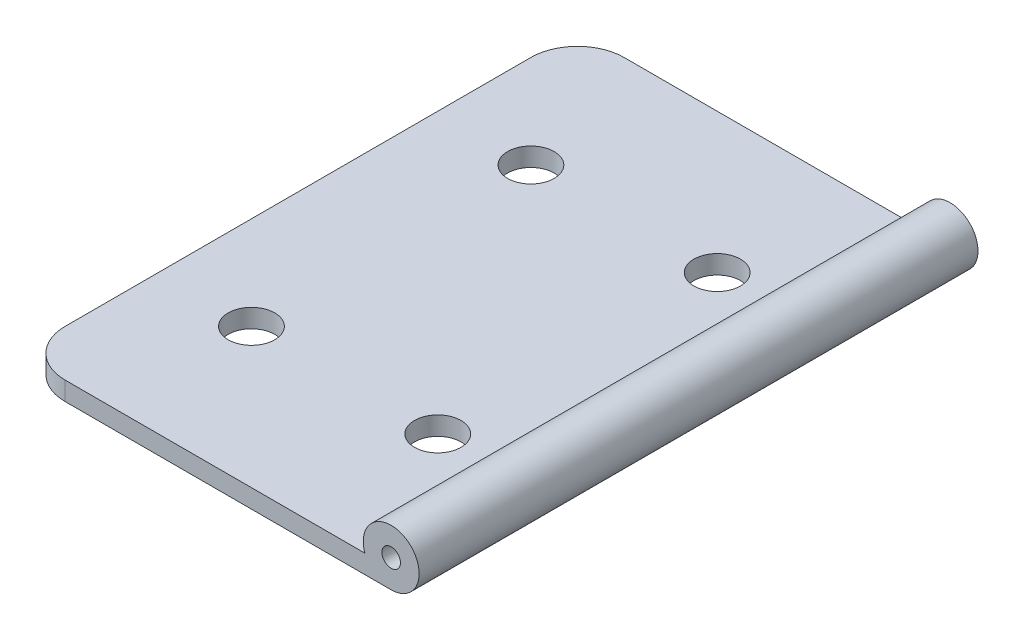
ISO-10303-21;
HEADER;
FILE_DESCRIPTION(('STEP AP214'),'2;1');
FILE_NAME('part.step','',(''),(''),'','','');
FILE_SCHEMA(('AUTOMOTIVE_DESIGN { 1 0 10303 214 1 1 1 1 }'));
ENDSEC;
DATA;
#1=APPLICATION_CONTEXT('core data for automotive mechanical design processes');
#2=APPLICATION_PROTOCOL_DEFINITION('international standard','automotive_design',2000,#1);
#3=PRODUCT_CONTEXT('',#1,'mechanical');
#4=PRODUCT('Part','Part','',(#3));
#5=PRODUCT_RELATED_PRODUCT_CATEGORY('part','',(#4));
#6=PRODUCT_DEFINITION_FORMATION('','',#4);
#7=PRODUCT_DEFINITION_CONTEXT('part definition',#1,'design');
#8=PRODUCT_DEFINITION('design','',#6,#7);
#9=PRODUCT_DEFINITION_SHAPE('','',#8);
#10=(LENGTH_UNIT() NAMED_UNIT(*) SI_UNIT(.MILLI.,.METRE.));
#11=(NAMED_UNIT(*) PLANE_ANGLE_UNIT() SI_UNIT($,.RADIAN.));
#12=(NAMED_UNIT(*) SI_UNIT($,.STERADIAN.) SOLID_ANGLE_UNIT());
#13=UNCERTAINTY_MEASURE_WITH_UNIT(LENGTH_MEASURE(1.E-05),#10,'distance_accuracy_value','');
#14=(GEOMETRIC_REPRESENTATION_CONTEXT(3) GLOBAL_UNCERTAINTY_ASSIGNED_CONTEXT((#13)) GLOBAL_UNIT_ASSIGNED_CONTEXT((#10,
#11,#12)) REPRESENTATION_CONTEXT('',''));
#15=CARTESIAN_POINT('',(0.,0.,0.));
#16=DIRECTION('',(0.,0.,1.));
#17=DIRECTION('',(1.,0.,0.));
#18=AXIS2_PLACEMENT_3D('',#15,#16,#17);
#19=CARTESIAN_POINT('',(0.,2.,0.));
#20=DIRECTION('',(0.,1.,0.));
#21=DIRECTION('',(0.,0.,1.));
#22=AXIS2_PLACEMENT_3D('',#19,#20,#21);
#23=PLANE('',#22);
#24=DIRECTION('',(0.,0.,1.));
#25=VECTOR('',#24,1.);
#26=CARTESIAN_POINT('',(-2.82842712474618,2.,-38.4852813742386));
#27=LINE('',#26,#25);
#28=CARTESIAN_POINT('',(-2.82842712474618,2.,-30.));
#29=VERTEX_POINT('',#28);
#30=CARTESIAN_POINT('',(-2.82842712474618,2.,30.));
#31=VERTEX_POINT('',#30);
#32=EDGE_CURVE('E88',#29,#31,#27,.T.);
#33=ORIENTED_EDGE('',*,*,#32,.F.);
#34=DIRECTION('',(-1.,0.,0.));
#35=VECTOR('',#34,1.);
#36=CARTESIAN_POINT('',(-40.,2.,-30.));
#37=LINE('',#36,#35);
#38=CARTESIAN_POINT('',(-35.,2.,-30.));
#39=VERTEX_POINT('',#38);
#40=EDGE_CURVE('E54',#29,#39,#37,.T.);
#41=ORIENTED_EDGE('',*,*,#40,.T.);
#42=CARTESIAN_POINT('',(-35.,2.,-25.));
#43=DIRECTION('',(0.,1.,0.));
#44=DIRECTION('',(0.,0.,1.));
#45=AXIS2_PLACEMENT_3D('',#42,#43,#44);
#46=CIRCLE('',#45,5.);
#47=CARTESIAN_POINT('',(-40.,2.,-25.));
#48=VERTEX_POINT('',#47);
#49=EDGE_CURVE('E40',#39,#48,#46,.T.);
#50=ORIENTED_EDGE('',*,*,#49,.T.);
#51=DIRECTION('',(0.,0.,1.));
#52=VECTOR('',#51,1.);
#53=CARTESIAN_POINT('',(-40.,2.,-30.));
#54=LINE('',#53,#52);
#55=CARTESIAN_POINT('',(-40.,2.,25.));
#56=VERTEX_POINT('',#55);
#57=EDGE_CURVE('E107',#48,#56,#54,.T.);
#58=ORIENTED_EDGE('',*,*,#57,.T.);
#59=CARTESIAN_POINT('',(-35.,2.,25.));
#60=DIRECTION('',(0.,1.,0.));
#61=DIRECTION('',(0.,0.,1.));
#62=AXIS2_PLACEMENT_3D('',#59,#60,#61);
#63=CIRCLE('',#62,5.);
#64=CARTESIAN_POINT('',(-35.,2.,30.));
#65=VERTEX_POINT('',#64);
#66=EDGE_CURVE('E47',#56,#65,#63,.T.);
#67=ORIENTED_EDGE('',*,*,#66,.T.);
#68=DIRECTION('',(1.,0.,0.));
#69=VECTOR('',#68,1.);
#70=CARTESIAN_POINT('',(-40.,2.,30.));
#71=LINE('',#70,#69);
#72=EDGE_CURVE('E99',#65,#31,#71,.T.);
#73=ORIENTED_EDGE('',*,*,#72,.T.);
#74=EDGE_LOOP('',(#33,#41,#50,#58,#67,#73));
#75=FACE_BOUND('',#74,.T.);
#76=CARTESIAN_POINT('',(-10.,2.,15.));
#77=DIRECTION('',(0.,1.,0.));
#78=DIRECTION('',(0.,0.,1.));
#79=AXIS2_PLACEMENT_3D('',#76,#77,#78);
#80=CIRCLE('',#79,2.5);
#81=CARTESIAN_POINT('',(-10.,2.,17.5));
#82=VERTEX_POINT('',#81);
#83=EDGE_CURVE('E164',#82,#82,#80,.T.);
#84=ORIENTED_EDGE('',*,*,#83,.F.);
#85=EDGE_LOOP('',(#84));
#86=FACE_BOUND('',#85,.T.);
#87=CARTESIAN_POINT('',(-30.,2.,-15.));
#88=DIRECTION('',(0.,1.,0.));
#89=DIRECTION('',(0.,0.,1.));
#90=AXIS2_PLACEMENT_3D('',#87,#88,#89);
#91=CIRCLE('',#90,2.5);
#92=CARTESIAN_POINT('',(-30.,2.,-12.5));
#93=VERTEX_POINT('',#92);
#94=EDGE_CURVE('E122',#93,#93,#91,.T.);
#95=ORIENTED_EDGE('',*,*,#94,.F.);
#96=EDGE_LOOP('',(#95));
#97=FACE_BOUND('',#96,.T.);
#98=CARTESIAN_POINT('',(-10.,2.,-15.));
#99=DIRECTION('',(0.,1.,0.));
#100=DIRECTION('',(0.,0.,-1.));
#101=AXIS2_PLACEMENT_3D('',#98,#99,#100);
#102=CIRCLE('',#101,2.5);
#103=CARTESIAN_POINT('',(-10.,2.,-17.5));
#104=VERTEX_POINT('',#103);
#105=EDGE_CURVE('E170',#104,#104,#102,.T.);
#106=ORIENTED_EDGE('',*,*,#105,.F.);
#107=EDGE_LOOP('',(#106));
#108=FACE_BOUND('',#107,.T.);
#109=CARTESIAN_POINT('',(-30.,2.,15.));
#110=DIRECTION('',(0.,1.,0.));
#111=DIRECTION('',(0.,0.,-1.));
#112=AXIS2_PLACEMENT_3D('',#109,#110,#111);
#113=CIRCLE('',#112,2.5);
#114=CARTESIAN_POINT('',(-30.,2.,12.5));
#115=VERTEX_POINT('',#114);
#116=EDGE_CURVE('E158',#115,#115,#113,.T.);
#117=ORIENTED_EDGE('',*,*,#116,.F.);
#118=EDGE_LOOP('',(#117));
#119=FACE_BOUND('',#118,.T.);
#120=ADVANCED_FACE('F32',(#75,#86,#97,#108,#119),#23,.T.);
#121=CARTESIAN_POINT('',(0.,0.,0.));
#122=DIRECTION('',(0.,1.,0.));
#123=DIRECTION('',(0.,0.,1.));
#124=AXIS2_PLACEMENT_3D('',#121,#122,#123);
#125=PLANE('',#124);
#126=DIRECTION('',(0.,0.,1.));
#127=VECTOR('',#126,1.);
#128=CARTESIAN_POINT('',(-40.,0.,-30.));
#129=LINE('',#128,#127);
#130=CARTESIAN_POINT('',(-40.,0.,-25.));
#131=VERTEX_POINT('',#130);
#132=CARTESIAN_POINT('',(-40.,0.,25.));
#133=VERTEX_POINT('',#132);
#134=EDGE_CURVE('E112',#131,#133,#129,.T.);
#135=ORIENTED_EDGE('',*,*,#134,.F.);
#136=CARTESIAN_POINT('',(-35.,0.,-25.));
#137=DIRECTION('',(0.,1.,0.));
#138=DIRECTION('',(0.,0.,1.));
#139=AXIS2_PLACEMENT_3D('',#136,#137,#138);
#140=CIRCLE('',#139,5.);
#141=CARTESIAN_POINT('',(-35.,0.,-30.));
#142=VERTEX_POINT('',#141);
#143=EDGE_CURVE('E132',#131,#142,#140,.F.);
#144=ORIENTED_EDGE('',*,*,#143,.T.);
#145=DIRECTION('',(-1.,0.,0.));
#146=VECTOR('',#145,1.);
#147=CARTESIAN_POINT('',(-40.,0.,-30.));
#148=LINE('',#147,#146);
#149=CARTESIAN_POINT('',(0.,0.,-30.));
#150=VERTEX_POINT('',#149);
#151=EDGE_CURVE('E121',#150,#142,#148,.T.);
#152=ORIENTED_EDGE('',*,*,#151,.F.);
#153=DIRECTION('',(0.,0.,-1.));
#154=VECTOR('',#153,1.);
#155=CARTESIAN_POINT('',(0.,0.,-30.));
#156=LINE('',#155,#154);
#157=CARTESIAN_POINT('',(0.,0.,30.));
#158=VERTEX_POINT('',#157);
#159=EDGE_CURVE('E91',#158,#150,#156,.T.);
#160=ORIENTED_EDGE('',*,*,#159,.F.);
#161=DIRECTION('',(1.,0.,0.));
#162=VECTOR('',#161,1.);
#163=CARTESIAN_POINT('',(-40.,0.,30.));
#164=LINE('',#163,#162);
#165=CARTESIAN_POINT('',(-35.,0.,30.));
#166=VERTEX_POINT('',#165);
#167=EDGE_CURVE('E108',#166,#158,#164,.T.);
#168=ORIENTED_EDGE('',*,*,#167,.F.);
#169=CARTESIAN_POINT('',(-35.,0.,25.));
#170=DIRECTION('',(0.,1.,0.));
#171=DIRECTION('',(0.,0.,1.));
#172=AXIS2_PLACEMENT_3D('',#169,#170,#171);
#173=CIRCLE('',#172,5.);
#174=EDGE_CURVE('E130',#166,#133,#173,.F.);
#175=ORIENTED_EDGE('',*,*,#174,.T.);
#176=EDGE_LOOP('',(#135,#144,#152,#160,#168,#175));
#177=FACE_BOUND('',#176,.T.);
#178=CARTESIAN_POINT('',(-30.,0.,-15.));
#179=DIRECTION('',(0.,1.,0.));
#180=DIRECTION('',(0.,0.,1.));
#181=AXIS2_PLACEMENT_3D('',#178,#179,#180);
#182=CIRCLE('',#181,2.5);
#183=CARTESIAN_POINT('',(-30.,0.,-12.5));
#184=VERTEX_POINT('',#183);
#185=EDGE_CURVE('E115',#184,#184,#182,.T.);
#186=ORIENTED_EDGE('',*,*,#185,.T.);
#187=EDGE_LOOP('',(#186));
#188=FACE_BOUND('',#187,.T.);
#189=CARTESIAN_POINT('',(-10.,0.,-15.));
#190=DIRECTION('',(0.,1.,0.));
#191=DIRECTION('',(0.,0.,-1.));
#192=AXIS2_PLACEMENT_3D('',#189,#190,#191);
#193=CIRCLE('',#192,2.5);
#194=CARTESIAN_POINT('',(-10.,0.,-17.5));
#195=VERTEX_POINT('',#194);
#196=EDGE_CURVE('E167',#195,#195,#193,.T.);
#197=ORIENTED_EDGE('',*,*,#196,.T.);
#198=EDGE_LOOP('',(#197));
#199=FACE_BOUND('',#198,.T.);
#200=CARTESIAN_POINT('',(-10.,0.,15.));
#201=DIRECTION('',(0.,1.,0.));
#202=DIRECTION('',(0.,0.,1.));
#203=AXIS2_PLACEMENT_3D('',#200,#201,#202);
#204=CIRCLE('',#203,2.5);
#205=CARTESIAN_POINT('',(-10.,0.,17.5));
#206=VERTEX_POINT('',#205);
#207=EDGE_CURVE('E161',#206,#206,#204,.T.);
#208=ORIENTED_EDGE('',*,*,#207,.T.);
#209=EDGE_LOOP('',(#208));
#210=FACE_BOUND('',#209,.T.);
#211=CARTESIAN_POINT('',(-30.,0.,15.));
#212=DIRECTION('',(0.,1.,0.));
#213=DIRECTION('',(0.,0.,-1.));
#214=AXIS2_PLACEMENT_3D('',#211,#212,#213);
#215=CIRCLE('',#214,2.5);
#216=CARTESIAN_POINT('',(-30.,0.,12.5));
#217=VERTEX_POINT('',#216);
#218=EDGE_CURVE('E100',#217,#217,#215,.T.);
#219=ORIENTED_EDGE('',*,*,#218,.T.);
#220=EDGE_LOOP('',(#219));
#221=FACE_BOUND('',#220,.T.);
#222=ADVANCED_FACE('F144',(#177,#188,#199,#210,#221),#125,.F.);
#223=CARTESIAN_POINT('',(-40.,2.,-30.));
#224=DIRECTION('',(0.,0.,1.));
#225=DIRECTION('',(1.,0.,0.));
#226=AXIS2_PLACEMENT_3D('',#223,#224,#225);
#227=PLANE('',#226);
#228=ORIENTED_EDGE('',*,*,#40,.F.);
#229=CARTESIAN_POINT('',(0.,3.,-30.));
#230=DIRECTION('',(0.,0.,1.));
#231=DIRECTION('',(1.,0.,0.));
#232=AXIS2_PLACEMENT_3D('',#229,#230,#231);
#233=CIRCLE('',#232,3.);
#234=EDGE_CURVE('E86',#29,#150,#233,.F.);
#235=ORIENTED_EDGE('',*,*,#234,.T.);
#236=ORIENTED_EDGE('',*,*,#151,.T.);
#237=DIRECTION('',(0.,-1.,0.));
#238=VECTOR('',#237,1.);
#239=CARTESIAN_POINT('',(-35.,2.,-30.));
#240=LINE('',#239,#238);
#241=EDGE_CURVE('E105',#142,#39,#240,.F.);
#242=ORIENTED_EDGE('',*,*,#241,.T.);
#243=EDGE_LOOP('',(#228,#235,#236,#242));
#244=FACE_BOUND('',#243,.T.);
#245=CARTESIAN_POINT('',(0.,3.,-30.));
#246=DIRECTION('',(0.,0.,1.));
#247=DIRECTION('',(1.,0.,0.));
#248=AXIS2_PLACEMENT_3D('',#245,#246,#247);
#249=CIRCLE('',#248,1.);
#250=CARTESIAN_POINT('',(1.00000000000001,3.,-30.));
#251=VERTEX_POINT('',#250);
#252=EDGE_CURVE('E95',#251,#251,#249,.F.);
#253=ORIENTED_EDGE('',*,*,#252,.F.);
#254=EDGE_LOOP('',(#253));
#255=FACE_BOUND('',#254,.T.);
#256=ADVANCED_FACE('F102',(#244,#255),#227,.F.);
#257=CARTESIAN_POINT('',(-40.,2.,-30.));
#258=DIRECTION('',(1.,0.,0.));
#259=DIRECTION('',(0.,0.,-1.));
#260=AXIS2_PLACEMENT_3D('',#257,#258,#259);
#261=PLANE('',#260);
#262=ORIENTED_EDGE('',*,*,#57,.F.);
#263=DIRECTION('',(0.,-1.,0.));
#264=VECTOR('',#263,1.);
#265=CARTESIAN_POINT('',(-40.,2.,-25.));
#266=LINE('',#265,#264);
#267=EDGE_CURVE('E127',#48,#131,#266,.T.);
#268=ORIENTED_EDGE('',*,*,#267,.T.);
#269=ORIENTED_EDGE('',*,*,#134,.T.);
#270=DIRECTION('',(0.,-1.,0.));
#271=VECTOR('',#270,1.);
#272=CARTESIAN_POINT('',(-40.,2.,25.));
#273=LINE('',#272,#271);
#274=EDGE_CURVE('E119',#133,#56,#273,.F.);
#275=ORIENTED_EDGE('',*,*,#274,.T.);
#276=EDGE_LOOP('',(#262,#268,#269,#275));
#277=FACE_BOUND('',#276,.T.);
#278=ADVANCED_FACE('F139',(#277),#261,.F.);
#279=CARTESIAN_POINT('',(-40.,2.,30.));
#280=DIRECTION('',(0.,0.,-1.));
#281=DIRECTION('',(-1.,0.,0.));
#282=AXIS2_PLACEMENT_3D('',#279,#280,#281);
#283=PLANE('',#282);
#284=CARTESIAN_POINT('',(0.,3.,30.));
#285=DIRECTION('',(0.,0.,1.));
#286=DIRECTION('',(1.,0.,0.));
#287=AXIS2_PLACEMENT_3D('',#284,#285,#286);
#288=CIRCLE('',#287,1.);
#289=CARTESIAN_POINT('',(1.00000000000001,3.,30.));
#290=VERTEX_POINT('',#289);
#291=EDGE_CURVE('E151',#290,#290,#288,.T.);
#292=ORIENTED_EDGE('',*,*,#291,.F.);
#293=EDGE_LOOP('',(#292));
#294=FACE_BOUND('',#293,.T.);
#295=ORIENTED_EDGE('',*,*,#167,.T.);
#296=CARTESIAN_POINT('',(0.,3.,30.));
#297=DIRECTION('',(0.,0.,1.));
#298=DIRECTION('',(1.,0.,0.));
#299=AXIS2_PLACEMENT_3D('',#296,#297,#298);
#300=CIRCLE('',#299,3.);
#301=EDGE_CURVE('E96',#158,#31,#300,.T.);
#302=ORIENTED_EDGE('',*,*,#301,.T.);
#303=ORIENTED_EDGE('',*,*,#72,.F.);
#304=DIRECTION('',(0.,-1.,0.));
#305=VECTOR('',#304,1.);
#306=CARTESIAN_POINT('',(-35.,2.,30.));
#307=LINE('',#306,#305);
#308=EDGE_CURVE('E11',#65,#166,#307,.T.);
#309=ORIENTED_EDGE('',*,*,#308,.T.);
#310=EDGE_LOOP('',(#295,#302,#303,#309));
#311=FACE_BOUND('',#310,.T.);
#312=ADVANCED_FACE('F150',(#294,#311),#283,.F.);
#313=CARTESIAN_POINT('',(-30.,2.,-15.));
#314=DIRECTION('',(0.,-1.,0.));
#315=DIRECTION('',(0.,0.,-1.));
#316=AXIS2_PLACEMENT_3D('',#313,#314,#315);
#317=CYLINDRICAL_SURFACE('',#316,2.5);
#318=ORIENTED_EDGE('',*,*,#94,.T.);
#319=EDGE_LOOP('',(#318));
#320=FACE_BOUND('',#319,.T.);
#321=ORIENTED_EDGE('',*,*,#185,.F.);
#322=EDGE_LOOP('',(#321));
#323=FACE_BOUND('',#322,.T.);
#324=ADVANCED_FACE('F181',(#320,#323),#317,.F.);
#325=CARTESIAN_POINT('',(-10.,2.,-15.));
#326=DIRECTION('',(0.,-1.,0.));
#327=DIRECTION('',(0.,0.,-1.));
#328=AXIS2_PLACEMENT_3D('',#325,#326,#327);
#329=CYLINDRICAL_SURFACE('',#328,2.5);
#330=ORIENTED_EDGE('',*,*,#105,.T.);
#331=EDGE_LOOP('',(#330));
#332=FACE_BOUND('',#331,.T.);
#333=ORIENTED_EDGE('',*,*,#196,.F.);
#334=EDGE_LOOP('',(#333));
#335=FACE_BOUND('',#334,.T.);
#336=ADVANCED_FACE('F183',(#332,#335),#329,.F.);
#337=CARTESIAN_POINT('',(-10.,2.,15.));
#338=DIRECTION('',(0.,-1.,0.));
#339=DIRECTION('',(0.,0.,-1.));
#340=AXIS2_PLACEMENT_3D('',#337,#338,#339);
#341=CYLINDRICAL_SURFACE('',#340,2.5);
#342=ORIENTED_EDGE('',*,*,#83,.T.);
#343=EDGE_LOOP('',(#342));
#344=FACE_BOUND('',#343,.T.);
#345=ORIENTED_EDGE('',*,*,#207,.F.);
#346=EDGE_LOOP('',(#345));
#347=FACE_BOUND('',#346,.T.);
#348=ADVANCED_FACE('F189',(#344,#347),#341,.F.);
#349=CARTESIAN_POINT('',(-30.,2.,15.));
#350=DIRECTION('',(0.,-1.,0.));
#351=DIRECTION('',(0.,0.,-1.));
#352=AXIS2_PLACEMENT_3D('',#349,#350,#351);
#353=CYLINDRICAL_SURFACE('',#352,2.5);
#354=ORIENTED_EDGE('',*,*,#116,.T.);
#355=EDGE_LOOP('',(#354));
#356=FACE_BOUND('',#355,.T.);
#357=ORIENTED_EDGE('',*,*,#218,.F.);
#358=EDGE_LOOP('',(#357));
#359=FACE_BOUND('',#358,.T.);
#360=ADVANCED_FACE('F205',(#356,#359),#353,.F.);
#361=CARTESIAN_POINT('',(-35.,2.,-25.));
#362=DIRECTION('',(0.,-1.,0.));
#363=DIRECTION('',(0.,0.,-1.));
#364=AXIS2_PLACEMENT_3D('',#361,#362,#363);
#365=CYLINDRICAL_SURFACE('',#364,5.);
#366=ORIENTED_EDGE('',*,*,#49,.F.);
#367=ORIENTED_EDGE('',*,*,#241,.F.);
#368=ORIENTED_EDGE('',*,*,#143,.F.);
#369=ORIENTED_EDGE('',*,*,#267,.F.);
#370=EDGE_LOOP('',(#366,#367,#368,#369));
#371=FACE_BOUND('',#370,.T.);
#372=ADVANCED_FACE('F142',(#371),#365,.T.);
#373=CARTESIAN_POINT('',(-35.,2.,25.));
#374=DIRECTION('',(0.,-1.,0.));
#375=DIRECTION('',(0.,0.,-1.));
#376=AXIS2_PLACEMENT_3D('',#373,#374,#375);
#377=CYLINDRICAL_SURFACE('',#376,5.);
#378=ORIENTED_EDGE('',*,*,#66,.F.);
#379=ORIENTED_EDGE('',*,*,#274,.F.);
#380=ORIENTED_EDGE('',*,*,#174,.F.);
#381=ORIENTED_EDGE('',*,*,#308,.F.);
#382=EDGE_LOOP('',(#378,#379,#380,#381));
#383=FACE_BOUND('',#382,.T.);
#384=ADVANCED_FACE('F34',(#383),#377,.T.);
#385=CARTESIAN_POINT('',(0.,3.,-38.4852813742386));
#386=DIRECTION('',(0.,0.,1.));
#387=DIRECTION('',(1.,0.,0.));
#388=AXIS2_PLACEMENT_3D('',#385,#386,#387);
#389=CYLINDRICAL_SURFACE('',#388,3.);
#390=ORIENTED_EDGE('',*,*,#234,.F.);
#391=ORIENTED_EDGE('',*,*,#32,.T.);
#392=ORIENTED_EDGE('',*,*,#301,.F.);
#393=ORIENTED_EDGE('',*,*,#159,.T.);
#394=EDGE_LOOP('',(#390,#391,#392,#393));
#395=FACE_BOUND('',#394,.T.);
#396=ADVANCED_FACE('F87',(#395),#389,.T.);
#397=CARTESIAN_POINT('',(0.,3.,-38.4852813742386));
#398=DIRECTION('',(0.,0.,1.));
#399=DIRECTION('',(1.,0.,0.));
#400=AXIS2_PLACEMENT_3D('',#397,#398,#399);
#401=CYLINDRICAL_SURFACE('',#400,1.);
#402=ORIENTED_EDGE('',*,*,#291,.T.);
#403=EDGE_LOOP('',(#402));
#404=FACE_BOUND('',#403,.T.);
#405=ORIENTED_EDGE('',*,*,#252,.T.);
#406=EDGE_LOOP('',(#405));
#407=FACE_BOUND('',#406,.T.);
#408=ADVANCED_FACE('F221',(#404,#407),#401,.F.);
#409=CLOSED_SHELL('',(#120,#222,#256,#278,#312,#324,#336,#348,#360,#372,#384,#396,#408));
#410=MANIFOLD_SOLID_BREP('B2',#409);
#411=ADVANCED_BREP_SHAPE_REPRESENTATION('',(#18,#410),#14);
#412=SHAPE_DEFINITION_REPRESENTATION(#9,#411);
ENDSEC;
END-ISO-10303-21;
